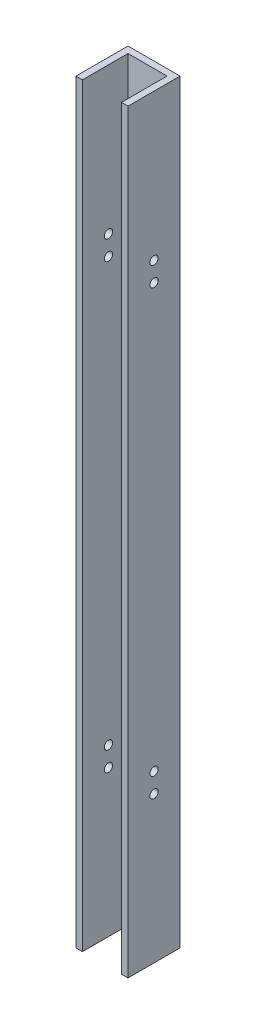
ISO-10303-21;
HEADER;
FILE_DESCRIPTION(('STEP AP214'),'2;1');
FILE_NAME('part.step','',(''),(''),'','','');
FILE_SCHEMA(('AUTOMOTIVE_DESIGN { 1 0 10303 214 1 1 1 1 }'));
ENDSEC;
DATA;
#1=APPLICATION_CONTEXT('core data for automotive mechanical design processes');
#2=APPLICATION_PROTOCOL_DEFINITION('international standard','automotive_design',2000,#1);
#3=PRODUCT_CONTEXT('',#1,'mechanical');
#4=PRODUCT('Part','Part','',(#3));
#5=PRODUCT_RELATED_PRODUCT_CATEGORY('part','',(#4));
#6=PRODUCT_DEFINITION_FORMATION('','',#4);
#7=PRODUCT_DEFINITION_CONTEXT('part definition',#1,'design');
#8=PRODUCT_DEFINITION('design','',#6,#7);
#9=PRODUCT_DEFINITION_SHAPE('','',#8);
#10=(LENGTH_UNIT() NAMED_UNIT(*) SI_UNIT(.MILLI.,.METRE.));
#11=(NAMED_UNIT(*) PLANE_ANGLE_UNIT() SI_UNIT($,.RADIAN.));
#12=(NAMED_UNIT(*) SI_UNIT($,.STERADIAN.) SOLID_ANGLE_UNIT());
#13=UNCERTAINTY_MEASURE_WITH_UNIT(LENGTH_MEASURE(1.E-05),#10,'distance_accuracy_value','');
#14=(GEOMETRIC_REPRESENTATION_CONTEXT(3) GLOBAL_UNCERTAINTY_ASSIGNED_CONTEXT((#13)) GLOBAL_UNIT_ASSIGNED_CONTEXT((#10,
#11,#12)) REPRESENTATION_CONTEXT('',''));
#15=CARTESIAN_POINT('',(0.,0.,0.));
#16=DIRECTION('',(0.,0.,1.));
#17=DIRECTION('',(1.,0.,0.));
#18=AXIS2_PLACEMENT_3D('',#15,#16,#17);
#19=CARTESIAN_POINT('',(0.,368.3,0.));
#20=DIRECTION('',(-1.,0.,0.));
#21=DIRECTION('',(0.,0.,1.));
#22=AXIS2_PLACEMENT_3D('',#19,#20,#21);
#23=PLANE('',#22);
#24=CARTESIAN_POINT('',(0.,71.4375,-12.7));
#25=DIRECTION('',(-1.,0.,0.));
#26=DIRECTION('',(0.,0.,1.));
#27=AXIS2_PLACEMENT_3D('',#24,#25,#26);
#28=CIRCLE('',#27,2.032);
#29=CARTESIAN_POINT('',(0.,71.4375,-10.668));
#30=VERTEX_POINT('',#29);
#31=EDGE_CURVE('E206',#30,#30,#28,.T.);
#32=ORIENTED_EDGE('',*,*,#31,.F.);
#33=EDGE_LOOP('',(#32));
#34=FACE_BOUND('',#33,.T.);
#35=CARTESIAN_POINT('',(0.,296.8625,-12.7));
#36=DIRECTION('',(-1.,0.,0.));
#37=DIRECTION('',(0.,0.,-1.));
#38=AXIS2_PLACEMENT_3D('',#35,#36,#37);
#39=CIRCLE('',#38,2.03200000000001);
#40=CARTESIAN_POINT('',(0.,296.8625,-14.732));
#41=VERTEX_POINT('',#40);
#42=EDGE_CURVE('E210',#41,#41,#39,.T.);
#43=ORIENTED_EDGE('',*,*,#42,.F.);
#44=EDGE_LOOP('',(#43));
#45=FACE_BOUND('',#44,.T.);
#46=CARTESIAN_POINT('',(0.,80.9625,-12.7));
#47=DIRECTION('',(-1.,0.,0.));
#48=DIRECTION('',(0.,0.,-1.));
#49=AXIS2_PLACEMENT_3D('',#46,#47,#48);
#50=CIRCLE('',#49,2.03200000000001);
#51=CARTESIAN_POINT('',(0.,80.9625,-14.732));
#52=VERTEX_POINT('',#51);
#53=EDGE_CURVE('E214',#52,#52,#50,.T.);
#54=ORIENTED_EDGE('',*,*,#53,.F.);
#55=EDGE_LOOP('',(#54));
#56=FACE_BOUND('',#55,.T.);
#57=CARTESIAN_POINT('',(0.,287.3375,-12.7));
#58=DIRECTION('',(-1.,0.,0.));
#59=DIRECTION('',(0.,0.,1.));
#60=AXIS2_PLACEMENT_3D('',#57,#58,#59);
#61=CIRCLE('',#60,2.03200000000001);
#62=CARTESIAN_POINT('',(0.,287.3375,-10.668));
#63=VERTEX_POINT('',#62);
#64=EDGE_CURVE('E217',#63,#63,#61,.T.);
#65=ORIENTED_EDGE('',*,*,#64,.F.);
#66=EDGE_LOOP('',(#65));
#67=FACE_BOUND('',#66,.T.);
#68=DIRECTION('',(0.,0.,-1.));
#69=VECTOR('',#68,1.);
#70=CARTESIAN_POINT('',(0.,0.,0.));
#71=LINE('',#70,#69);
#72=CARTESIAN_POINT('',(0.,0.,0.));
#73=VERTEX_POINT('',#72);
#74=CARTESIAN_POINT('',(0.,0.,-25.4));
#75=VERTEX_POINT('',#74);
#76=EDGE_CURVE('E131',#73,#75,#71,.T.);
#77=ORIENTED_EDGE('',*,*,#76,.F.);
#78=DIRECTION('',(0.,-1.,0.));
#79=VECTOR('',#78,1.);
#80=CARTESIAN_POINT('',(0.,368.3,0.));
#81=LINE('',#80,#79);
#82=CARTESIAN_POINT('',(0.,368.3,0.));
#83=VERTEX_POINT('',#82);
#84=EDGE_CURVE('E11',#83,#73,#81,.T.);
#85=ORIENTED_EDGE('',*,*,#84,.F.);
#86=DIRECTION('',(0.,0.,-1.));
#87=VECTOR('',#86,1.);
#88=CARTESIAN_POINT('',(0.,368.3,0.));
#89=LINE('',#88,#87);
#90=CARTESIAN_POINT('',(0.,368.3,-25.4));
#91=VERTEX_POINT('',#90);
#92=EDGE_CURVE('E151',#83,#91,#89,.T.);
#93=ORIENTED_EDGE('',*,*,#92,.T.);
#94=DIRECTION('',(0.,-1.,0.));
#95=VECTOR('',#94,1.);
#96=CARTESIAN_POINT('',(0.,368.3,-25.4));
#97=LINE('',#96,#95);
#98=EDGE_CURVE('E36',#91,#75,#97,.T.);
#99=ORIENTED_EDGE('',*,*,#98,.T.);
#100=EDGE_LOOP('',(#77,#85,#93,#99));
#101=FACE_BOUND('',#100,.T.);
#102=ADVANCED_FACE('F33',(#34,#45,#56,#67,#101),#23,.T.);
#103=CARTESIAN_POINT('',(0.,368.3,0.));
#104=DIRECTION('',(0.,0.,-1.));
#105=DIRECTION('',(-1.,0.,0.));
#106=AXIS2_PLACEMENT_3D('',#103,#104,#105);
#107=PLANE('',#106);
#108=DIRECTION('',(1.,0.,0.));
#109=VECTOR('',#108,1.);
#110=CARTESIAN_POINT('',(0.,0.,0.));
#111=LINE('',#110,#109);
#112=CARTESIAN_POINT('',(3.175,0.,0.));
#113=VERTEX_POINT('',#112);
#114=EDGE_CURVE('E150',#73,#113,#111,.T.);
#115=ORIENTED_EDGE('',*,*,#114,.T.);
#116=DIRECTION('',(0.,-1.,0.));
#117=VECTOR('',#116,1.);
#118=CARTESIAN_POINT('',(3.175,368.3,0.));
#119=LINE('',#118,#117);
#120=CARTESIAN_POINT('',(3.175,368.3,0.));
#121=VERTEX_POINT('',#120);
#122=EDGE_CURVE('E42',#121,#113,#119,.T.);
#123=ORIENTED_EDGE('',*,*,#122,.F.);
#124=DIRECTION('',(1.,0.,0.));
#125=VECTOR('',#124,1.);
#126=CARTESIAN_POINT('',(0.,368.3,0.));
#127=LINE('',#126,#125);
#128=EDGE_CURVE('E121',#83,#121,#127,.T.);
#129=ORIENTED_EDGE('',*,*,#128,.F.);
#130=ORIENTED_EDGE('',*,*,#84,.T.);
#131=EDGE_LOOP('',(#115,#123,#129,#130));
#132=FACE_BOUND('',#131,.T.);
#133=ADVANCED_FACE('F163',(#132),#107,.F.);
#134=CARTESIAN_POINT('',(3.175,368.3,-22.225));
#135=DIRECTION('',(1.,0.,0.));
#136=DIRECTION('',(0.,0.,-1.));
#137=AXIS2_PLACEMENT_3D('',#134,#135,#136);
#138=PLANE('',#137);
#139=CARTESIAN_POINT('',(3.175,71.4375,-12.7));
#140=DIRECTION('',(1.,0.,0.));
#141=DIRECTION('',(0.,0.,-1.));
#142=AXIS2_PLACEMENT_3D('',#139,#140,#141);
#143=CIRCLE('',#142,2.032);
#144=CARTESIAN_POINT('',(3.175,71.4375,-14.732));
#145=VERTEX_POINT('',#144);
#146=EDGE_CURVE('E135',#145,#145,#143,.T.);
#147=ORIENTED_EDGE('',*,*,#146,.F.);
#148=EDGE_LOOP('',(#147));
#149=FACE_BOUND('',#148,.T.);
#150=CARTESIAN_POINT('',(3.175,296.8625,-12.7));
#151=DIRECTION('',(1.,0.,0.));
#152=DIRECTION('',(0.,0.,-1.));
#153=AXIS2_PLACEMENT_3D('',#150,#151,#152);
#154=CIRCLE('',#153,2.03200000000001);
#155=CARTESIAN_POINT('',(3.175,296.8625,-14.732));
#156=VERTEX_POINT('',#155);
#157=EDGE_CURVE('E243',#156,#156,#154,.T.);
#158=ORIENTED_EDGE('',*,*,#157,.F.);
#159=EDGE_LOOP('',(#158));
#160=FACE_BOUND('',#159,.T.);
#161=CARTESIAN_POINT('',(3.175,80.9625,-12.7));
#162=DIRECTION('',(1.,0.,0.));
#163=DIRECTION('',(0.,0.,-1.));
#164=AXIS2_PLACEMENT_3D('',#161,#162,#163);
#165=CIRCLE('',#164,2.03200000000001);
#166=CARTESIAN_POINT('',(3.175,80.9625,-14.732));
#167=VERTEX_POINT('',#166);
#168=EDGE_CURVE('E237',#167,#167,#165,.T.);
#169=ORIENTED_EDGE('',*,*,#168,.F.);
#170=EDGE_LOOP('',(#169));
#171=FACE_BOUND('',#170,.T.);
#172=CARTESIAN_POINT('',(3.175,287.3375,-12.7));
#173=DIRECTION('',(1.,0.,0.));
#174=DIRECTION('',(0.,0.,-1.));
#175=AXIS2_PLACEMENT_3D('',#172,#173,#174);
#176=CIRCLE('',#175,2.03200000000001);
#177=CARTESIAN_POINT('',(3.175,287.3375,-14.732));
#178=VERTEX_POINT('',#177);
#179=EDGE_CURVE('E231',#178,#178,#176,.T.);
#180=ORIENTED_EDGE('',*,*,#179,.F.);
#181=EDGE_LOOP('',(#180));
#182=FACE_BOUND('',#181,.T.);
#183=DIRECTION('',(0.,0.,1.));
#184=VECTOR('',#183,1.);
#185=CARTESIAN_POINT('',(3.175,0.,-22.225));
#186=LINE('',#185,#184);
#187=CARTESIAN_POINT('',(3.175,0.,-22.225));
#188=VERTEX_POINT('',#187);
#189=EDGE_CURVE('E107',#188,#113,#186,.T.);
#190=ORIENTED_EDGE('',*,*,#189,.F.);
#191=DIRECTION('',(0.,-1.,0.));
#192=VECTOR('',#191,1.);
#193=CARTESIAN_POINT('',(3.175,368.3,-22.225));
#194=LINE('',#193,#192);
#195=CARTESIAN_POINT('',(3.175,368.3,-22.225));
#196=VERTEX_POINT('',#195);
#197=EDGE_CURVE('E102',#196,#188,#194,.T.);
#198=ORIENTED_EDGE('',*,*,#197,.F.);
#199=DIRECTION('',(0.,0.,1.));
#200=VECTOR('',#199,1.);
#201=CARTESIAN_POINT('',(3.175,368.3,-22.225));
#202=LINE('',#201,#200);
#203=EDGE_CURVE('E105',#196,#121,#202,.T.);
#204=ORIENTED_EDGE('',*,*,#203,.T.);
#205=ORIENTED_EDGE('',*,*,#122,.T.);
#206=EDGE_LOOP('',(#190,#198,#204,#205));
#207=FACE_BOUND('',#206,.T.);
#208=ADVANCED_FACE('F104',(#149,#160,#171,#182,#207),#138,.T.);
#209=CARTESIAN_POINT('',(22.225,368.3,-22.225));
#210=DIRECTION('',(0.,0.,1.));
#211=DIRECTION('',(1.,0.,0.));
#212=AXIS2_PLACEMENT_3D('',#209,#210,#211);
#213=PLANE('',#212);
#214=DIRECTION('',(-1.,0.,0.));
#215=VECTOR('',#214,1.);
#216=CARTESIAN_POINT('',(22.225,0.,-22.225));
#217=LINE('',#216,#215);
#218=CARTESIAN_POINT('',(22.225,0.,-22.225));
#219=VERTEX_POINT('',#218);
#220=EDGE_CURVE('E147',#219,#188,#217,.T.);
#221=ORIENTED_EDGE('',*,*,#220,.F.);
#222=DIRECTION('',(0.,-1.,0.));
#223=VECTOR('',#222,1.);
#224=CARTESIAN_POINT('',(22.225,368.3,-22.225));
#225=LINE('',#224,#223);
#226=CARTESIAN_POINT('',(22.225,368.3,-22.225));
#227=VERTEX_POINT('',#226);
#228=EDGE_CURVE('E112',#227,#219,#225,.T.);
#229=ORIENTED_EDGE('',*,*,#228,.F.);
#230=DIRECTION('',(-1.,0.,0.));
#231=VECTOR('',#230,1.);
#232=CARTESIAN_POINT('',(22.225,368.3,-22.225));
#233=LINE('',#232,#231);
#234=EDGE_CURVE('E119',#227,#196,#233,.T.);
#235=ORIENTED_EDGE('',*,*,#234,.T.);
#236=ORIENTED_EDGE('',*,*,#197,.T.);
#237=EDGE_LOOP('',(#221,#229,#235,#236));
#238=FACE_BOUND('',#237,.T.);
#239=ADVANCED_FACE('F123',(#238),#213,.T.);
#240=CARTESIAN_POINT('',(22.225,368.3,0.));
#241=DIRECTION('',(-1.,0.,0.));
#242=DIRECTION('',(0.,0.,1.));
#243=AXIS2_PLACEMENT_3D('',#240,#241,#242);
#244=PLANE('',#243);
#245=CARTESIAN_POINT('',(22.225,71.4375,-12.7));
#246=DIRECTION('',(-1.,0.,0.));
#247=DIRECTION('',(0.,0.,1.));
#248=AXIS2_PLACEMENT_3D('',#245,#246,#247);
#249=CIRCLE('',#248,2.032);
#250=CARTESIAN_POINT('',(22.225,71.4375,-10.668));
#251=VERTEX_POINT('',#250);
#252=EDGE_CURVE('E245',#251,#251,#249,.T.);
#253=ORIENTED_EDGE('',*,*,#252,.F.);
#254=EDGE_LOOP('',(#253));
#255=FACE_BOUND('',#254,.T.);
#256=CARTESIAN_POINT('',(22.225,296.8625,-12.7));
#257=DIRECTION('',(-1.,0.,0.));
#258=DIRECTION('',(0.,0.,1.));
#259=AXIS2_PLACEMENT_3D('',#256,#257,#258);
#260=CIRCLE('',#259,2.03200000000001);
#261=CARTESIAN_POINT('',(22.225,296.8625,-10.668));
#262=VERTEX_POINT('',#261);
#263=EDGE_CURVE('E240',#262,#262,#260,.T.);
#264=ORIENTED_EDGE('',*,*,#263,.F.);
#265=EDGE_LOOP('',(#264));
#266=FACE_BOUND('',#265,.T.);
#267=CARTESIAN_POINT('',(22.225,80.9625,-12.7));
#268=DIRECTION('',(-1.,0.,0.));
#269=DIRECTION('',(0.,0.,1.));
#270=AXIS2_PLACEMENT_3D('',#267,#268,#269);
#271=CIRCLE('',#270,2.03200000000001);
#272=CARTESIAN_POINT('',(22.225,80.9625,-10.668));
#273=VERTEX_POINT('',#272);
#274=EDGE_CURVE('E234',#273,#273,#271,.T.);
#275=ORIENTED_EDGE('',*,*,#274,.F.);
#276=EDGE_LOOP('',(#275));
#277=FACE_BOUND('',#276,.T.);
#278=CARTESIAN_POINT('',(22.225,287.3375,-12.7));
#279=DIRECTION('',(-1.,0.,0.));
#280=DIRECTION('',(0.,0.,1.));
#281=AXIS2_PLACEMENT_3D('',#278,#279,#280);
#282=CIRCLE('',#281,2.03200000000001);
#283=CARTESIAN_POINT('',(22.225,287.3375,-10.668));
#284=VERTEX_POINT('',#283);
#285=EDGE_CURVE('E223',#284,#284,#282,.T.);
#286=ORIENTED_EDGE('',*,*,#285,.F.);
#287=EDGE_LOOP('',(#286));
#288=FACE_BOUND('',#287,.T.);
#289=DIRECTION('',(0.,0.,-1.));
#290=VECTOR('',#289,1.);
#291=CARTESIAN_POINT('',(22.225,0.,0.));
#292=LINE('',#291,#290);
#293=CARTESIAN_POINT('',(22.225,0.,0.));
#294=VERTEX_POINT('',#293);
#295=EDGE_CURVE('E144',#294,#219,#292,.T.);
#296=ORIENTED_EDGE('',*,*,#295,.F.);
#297=DIRECTION('',(0.,-1.,0.));
#298=VECTOR('',#297,1.);
#299=CARTESIAN_POINT('',(22.225,368.3,0.));
#300=LINE('',#299,#298);
#301=CARTESIAN_POINT('',(22.225,368.3,0.));
#302=VERTEX_POINT('',#301);
#303=EDGE_CURVE('E155',#302,#294,#300,.T.);
#304=ORIENTED_EDGE('',*,*,#303,.F.);
#305=DIRECTION('',(0.,0.,-1.));
#306=VECTOR('',#305,1.);
#307=CARTESIAN_POINT('',(22.225,368.3,0.));
#308=LINE('',#307,#306);
#309=EDGE_CURVE('E124',#302,#227,#308,.T.);
#310=ORIENTED_EDGE('',*,*,#309,.T.);
#311=ORIENTED_EDGE('',*,*,#228,.T.);
#312=EDGE_LOOP('',(#296,#304,#310,#311));
#313=FACE_BOUND('',#312,.T.);
#314=ADVANCED_FACE('F182',(#255,#266,#277,#288,#313),#244,.T.);
#315=CARTESIAN_POINT('',(25.4,368.3,0.));
#316=DIRECTION('',(0.,0.,1.));
#317=DIRECTION('',(1.,0.,0.));
#318=AXIS2_PLACEMENT_3D('',#315,#316,#317);
#319=PLANE('',#318);
#320=DIRECTION('',(-1.,0.,0.));
#321=VECTOR('',#320,1.);
#322=CARTESIAN_POINT('',(25.4,0.,0.));
#323=LINE('',#322,#321);
#324=CARTESIAN_POINT('',(25.4,0.,0.));
#325=VERTEX_POINT('',#324);
#326=EDGE_CURVE('E141',#325,#294,#323,.T.);
#327=ORIENTED_EDGE('',*,*,#326,.F.);
#328=DIRECTION('',(0.,-1.,0.));
#329=VECTOR('',#328,1.);
#330=CARTESIAN_POINT('',(25.4,368.3,0.));
#331=LINE('',#330,#329);
#332=CARTESIAN_POINT('',(25.4,368.3,0.));
#333=VERTEX_POINT('',#332);
#334=EDGE_CURVE('E157',#333,#325,#331,.T.);
#335=ORIENTED_EDGE('',*,*,#334,.F.);
#336=DIRECTION('',(-1.,0.,0.));
#337=VECTOR('',#336,1.);
#338=CARTESIAN_POINT('',(25.4,368.3,0.));
#339=LINE('',#338,#337);
#340=EDGE_CURVE('E126',#333,#302,#339,.T.);
#341=ORIENTED_EDGE('',*,*,#340,.T.);
#342=ORIENTED_EDGE('',*,*,#303,.T.);
#343=EDGE_LOOP('',(#327,#335,#341,#342));
#344=FACE_BOUND('',#343,.T.);
#345=ADVANCED_FACE('F177',(#344),#319,.T.);
#346=CARTESIAN_POINT('',(25.4,368.3,-25.4));
#347=DIRECTION('',(1.,0.,0.));
#348=DIRECTION('',(0.,0.,-1.));
#349=AXIS2_PLACEMENT_3D('',#346,#347,#348);
#350=PLANE('',#349);
#351=CARTESIAN_POINT('',(25.4,71.4375,-12.7));
#352=DIRECTION('',(-1.,0.,0.));
#353=DIRECTION('',(0.,0.,1.));
#354=AXIS2_PLACEMENT_3D('',#351,#352,#353);
#355=CIRCLE('',#354,2.032);
#356=CARTESIAN_POINT('',(25.4,71.4375,-10.668));
#357=VERTEX_POINT('',#356);
#358=EDGE_CURVE('E220',#357,#357,#355,.T.);
#359=ORIENTED_EDGE('',*,*,#358,.T.);
#360=EDGE_LOOP('',(#359));
#361=FACE_BOUND('',#360,.T.);
#362=CARTESIAN_POINT('',(25.4,296.8625,-12.7));
#363=DIRECTION('',(-1.,0.,0.));
#364=DIRECTION('',(0.,0.,-1.));
#365=AXIS2_PLACEMENT_3D('',#362,#363,#364);
#366=CIRCLE('',#365,2.03200000000001);
#367=CARTESIAN_POINT('',(25.4,296.8625,-14.732));
#368=VERTEX_POINT('',#367);
#369=EDGE_CURVE('E302',#368,#368,#366,.T.);
#370=ORIENTED_EDGE('',*,*,#369,.T.);
#371=EDGE_LOOP('',(#370));
#372=FACE_BOUND('',#371,.T.);
#373=CARTESIAN_POINT('',(25.4,80.9625,-12.7));
#374=DIRECTION('',(-1.,0.,0.));
#375=DIRECTION('',(0.,0.,-1.));
#376=AXIS2_PLACEMENT_3D('',#373,#374,#375);
#377=CIRCLE('',#376,2.03200000000001);
#378=CARTESIAN_POINT('',(25.4,80.9625,-14.732));
#379=VERTEX_POINT('',#378);
#380=EDGE_CURVE('E305',#379,#379,#377,.T.);
#381=ORIENTED_EDGE('',*,*,#380,.T.);
#382=EDGE_LOOP('',(#381));
#383=FACE_BOUND('',#382,.T.);
#384=CARTESIAN_POINT('',(25.4,287.3375,-12.7));
#385=DIRECTION('',(-1.,0.,0.));
#386=DIRECTION('',(0.,0.,1.));
#387=AXIS2_PLACEMENT_3D('',#384,#385,#386);
#388=CIRCLE('',#387,2.03200000000001);
#389=CARTESIAN_POINT('',(25.4,287.3375,-10.668));
#390=VERTEX_POINT('',#389);
#391=EDGE_CURVE('E219',#390,#390,#388,.T.);
#392=ORIENTED_EDGE('',*,*,#391,.T.);
#393=EDGE_LOOP('',(#392));
#394=FACE_BOUND('',#393,.T.);
#395=DIRECTION('',(0.,0.,1.));
#396=VECTOR('',#395,1.);
#397=CARTESIAN_POINT('',(25.4,0.,-25.4));
#398=LINE('',#397,#396);
#399=CARTESIAN_POINT('',(25.4,0.,-25.4));
#400=VERTEX_POINT('',#399);
#401=EDGE_CURVE('E138',#400,#325,#398,.T.);
#402=ORIENTED_EDGE('',*,*,#401,.F.);
#403=DIRECTION('',(0.,-1.,0.));
#404=VECTOR('',#403,1.);
#405=CARTESIAN_POINT('',(25.4,368.3,-25.4));
#406=LINE('',#405,#404);
#407=CARTESIAN_POINT('',(25.4,368.3,-25.4));
#408=VERTEX_POINT('',#407);
#409=EDGE_CURVE('E158',#408,#400,#406,.T.);
#410=ORIENTED_EDGE('',*,*,#409,.F.);
#411=DIRECTION('',(0.,0.,1.));
#412=VECTOR('',#411,1.);
#413=CARTESIAN_POINT('',(25.4,368.3,-25.4));
#414=LINE('',#413,#412);
#415=EDGE_CURVE('E167',#408,#333,#414,.T.);
#416=ORIENTED_EDGE('',*,*,#415,.T.);
#417=ORIENTED_EDGE('',*,*,#334,.T.);
#418=EDGE_LOOP('',(#402,#410,#416,#417));
#419=FACE_BOUND('',#418,.T.);
#420=ADVANCED_FACE('F180',(#361,#372,#383,#394,#419),#350,.T.);
#421=CARTESIAN_POINT('',(0.,368.3,-25.4));
#422=DIRECTION('',(0.,0.,-1.));
#423=DIRECTION('',(-1.,0.,0.));
#424=AXIS2_PLACEMENT_3D('',#421,#422,#423);
#425=PLANE('',#424);
#426=DIRECTION('',(1.,0.,0.));
#427=VECTOR('',#426,1.);
#428=CARTESIAN_POINT('',(0.,0.,-25.4));
#429=LINE('',#428,#427);
#430=EDGE_CURVE('E134',#75,#400,#429,.T.);
#431=ORIENTED_EDGE('',*,*,#430,.F.);
#432=ORIENTED_EDGE('',*,*,#98,.F.);
#433=DIRECTION('',(1.,0.,0.));
#434=VECTOR('',#433,1.);
#435=CARTESIAN_POINT('',(0.,368.3,-25.4));
#436=LINE('',#435,#434);
#437=EDGE_CURVE('E165',#91,#408,#436,.T.);
#438=ORIENTED_EDGE('',*,*,#437,.T.);
#439=ORIENTED_EDGE('',*,*,#409,.T.);
#440=EDGE_LOOP('',(#431,#432,#438,#439));
#441=FACE_BOUND('',#440,.T.);
#442=ADVANCED_FACE('F160',(#441),#425,.T.);
#443=CARTESIAN_POINT('',(0.,368.3,0.));
#444=DIRECTION('',(0.,-1.,0.));
#445=DIRECTION('',(0.,0.,-1.));
#446=AXIS2_PLACEMENT_3D('',#443,#444,#445);
#447=PLANE('',#446);
#448=ORIENTED_EDGE('',*,*,#92,.F.);
#449=ORIENTED_EDGE('',*,*,#128,.T.);
#450=ORIENTED_EDGE('',*,*,#203,.F.);
#451=ORIENTED_EDGE('',*,*,#234,.F.);
#452=ORIENTED_EDGE('',*,*,#309,.F.);
#453=ORIENTED_EDGE('',*,*,#340,.F.);
#454=ORIENTED_EDGE('',*,*,#415,.F.);
#455=ORIENTED_EDGE('',*,*,#437,.F.);
#456=EDGE_LOOP('',(#448,#449,#450,#451,#452,#453,#454,#455));
#457=FACE_BOUND('',#456,.T.);
#458=ADVANCED_FACE('F117',(#457),#447,.F.);
#459=CARTESIAN_POINT('',(0.,0.,0.));
#460=DIRECTION('',(0.,-1.,0.));
#461=DIRECTION('',(0.,0.,-1.));
#462=AXIS2_PLACEMENT_3D('',#459,#460,#461);
#463=PLANE('',#462);
#464=ORIENTED_EDGE('',*,*,#76,.T.);
#465=ORIENTED_EDGE('',*,*,#430,.T.);
#466=ORIENTED_EDGE('',*,*,#401,.T.);
#467=ORIENTED_EDGE('',*,*,#326,.T.);
#468=ORIENTED_EDGE('',*,*,#295,.T.);
#469=ORIENTED_EDGE('',*,*,#220,.T.);
#470=ORIENTED_EDGE('',*,*,#189,.T.);
#471=ORIENTED_EDGE('',*,*,#114,.F.);
#472=EDGE_LOOP('',(#464,#465,#466,#467,#468,#469,#470,#471));
#473=FACE_BOUND('',#472,.T.);
#474=ADVANCED_FACE('F162',(#473),#463,.T.);
#475=CARTESIAN_POINT('',(25.4,287.3375,-12.7));
#476=DIRECTION('',(-1.,0.,0.));
#477=DIRECTION('',(0.,0.,1.));
#478=AXIS2_PLACEMENT_3D('',#475,#476,#477);
#479=CYLINDRICAL_SURFACE('',#478,2.03200000000001);
#480=ORIENTED_EDGE('',*,*,#285,.T.);
#481=EDGE_LOOP('',(#480));
#482=FACE_BOUND('',#481,.T.);
#483=ORIENTED_EDGE('',*,*,#391,.F.);
#484=EDGE_LOOP('',(#483));
#485=FACE_BOUND('',#484,.T.);
#486=ADVANCED_FACE('F267',(#482,#485),#479,.F.);
#487=CARTESIAN_POINT('',(25.4,80.9625,-12.7));
#488=DIRECTION('',(-1.,0.,0.));
#489=DIRECTION('',(0.,0.,1.));
#490=AXIS2_PLACEMENT_3D('',#487,#488,#489);
#491=CYLINDRICAL_SURFACE('',#490,2.03200000000001);
#492=ORIENTED_EDGE('',*,*,#274,.T.);
#493=EDGE_LOOP('',(#492));
#494=FACE_BOUND('',#493,.T.);
#495=ORIENTED_EDGE('',*,*,#380,.F.);
#496=EDGE_LOOP('',(#495));
#497=FACE_BOUND('',#496,.T.);
#498=ADVANCED_FACE('F275',(#494,#497),#491,.F.);
#499=CARTESIAN_POINT('',(25.4,296.8625,-12.7));
#500=DIRECTION('',(-1.,0.,0.));
#501=DIRECTION('',(0.,0.,1.));
#502=AXIS2_PLACEMENT_3D('',#499,#500,#501);
#503=CYLINDRICAL_SURFACE('',#502,2.03200000000001);
#504=ORIENTED_EDGE('',*,*,#263,.T.);
#505=EDGE_LOOP('',(#504));
#506=FACE_BOUND('',#505,.T.);
#507=ORIENTED_EDGE('',*,*,#369,.F.);
#508=EDGE_LOOP('',(#507));
#509=FACE_BOUND('',#508,.T.);
#510=ADVANCED_FACE('F276',(#506,#509),#503,.F.);
#511=CARTESIAN_POINT('',(25.4,71.4375,-12.7));
#512=DIRECTION('',(-1.,0.,0.));
#513=DIRECTION('',(0.,0.,1.));
#514=AXIS2_PLACEMENT_3D('',#511,#512,#513);
#515=CYLINDRICAL_SURFACE('',#514,2.032);
#516=ORIENTED_EDGE('',*,*,#252,.T.);
#517=EDGE_LOOP('',(#516));
#518=FACE_BOUND('',#517,.T.);
#519=ORIENTED_EDGE('',*,*,#358,.F.);
#520=EDGE_LOOP('',(#519));
#521=FACE_BOUND('',#520,.T.);
#522=ADVANCED_FACE('F265',(#518,#521),#515,.F.);
#523=ORIENTED_EDGE('',*,*,#179,.T.);
#524=EDGE_LOOP('',(#523));
#525=FACE_BOUND('',#524,.T.);
#526=ORIENTED_EDGE('',*,*,#64,.T.);
#527=EDGE_LOOP('',(#526));
#528=FACE_BOUND('',#527,.T.);
#529=ADVANCED_FACE('F262',(#525,#528),#479,.F.);
#530=ORIENTED_EDGE('',*,*,#168,.T.);
#531=EDGE_LOOP('',(#530));
#532=FACE_BOUND('',#531,.T.);
#533=ORIENTED_EDGE('',*,*,#53,.T.);
#534=EDGE_LOOP('',(#533));
#535=FACE_BOUND('',#534,.T.);
#536=ADVANCED_FACE('F264',(#532,#535),#491,.F.);
#537=ORIENTED_EDGE('',*,*,#157,.T.);
#538=EDGE_LOOP('',(#537));
#539=FACE_BOUND('',#538,.T.);
#540=ORIENTED_EDGE('',*,*,#42,.T.);
#541=EDGE_LOOP('',(#540));
#542=FACE_BOUND('',#541,.T.);
#543=ADVANCED_FACE('F272',(#539,#542),#503,.F.);
#544=ORIENTED_EDGE('',*,*,#146,.T.);
#545=EDGE_LOOP('',(#544));
#546=FACE_BOUND('',#545,.T.);
#547=ORIENTED_EDGE('',*,*,#31,.T.);
#548=EDGE_LOOP('',(#547));
#549=FACE_BOUND('',#548,.T.);
#550=ADVANCED_FACE('F251',(#546,#549),#515,.F.);
#551=CLOSED_SHELL('',(#102,#133,#208,#239,#314,#345,#420,#442,#458,#474,#486,#498,#510,#522,
#529,#536,#543,#550));
#552=MANIFOLD_SOLID_BREP('B2',#551);
#553=ADVANCED_BREP_SHAPE_REPRESENTATION('',(#18,#552),#14);
#554=SHAPE_DEFINITION_REPRESENTATION(#9,#553);
ENDSEC;
END-ISO-10303-21;
